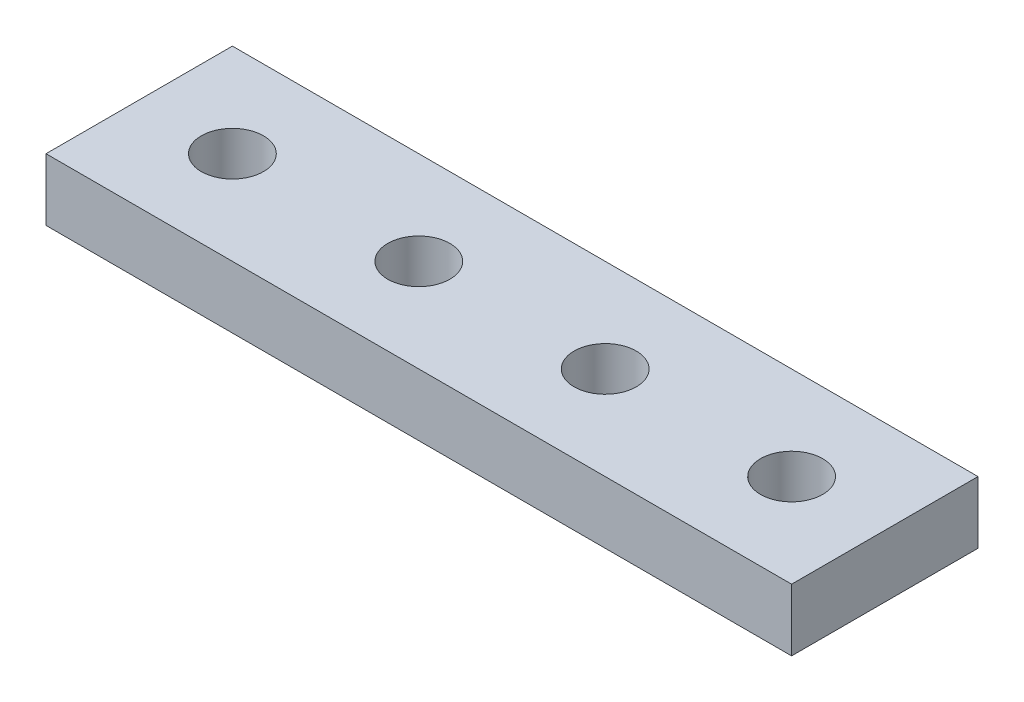
ISO-10303-21;
HEADER;
FILE_DESCRIPTION(('STEP AP214'),'2;1');
FILE_NAME('part.step','',(''),(''),'','','');
FILE_SCHEMA(('AUTOMOTIVE_DESIGN { 1 0 10303 214 1 1 1 1 }'));
ENDSEC;
DATA;
#1=APPLICATION_CONTEXT('core data for automotive mechanical design processes');
#2=APPLICATION_PROTOCOL_DEFINITION('international standard','automotive_design',2000,#1);
#3=PRODUCT_CONTEXT('',#1,'mechanical');
#4=PRODUCT('Part','Part','',(#3));
#5=PRODUCT_RELATED_PRODUCT_CATEGORY('part','',(#4));
#6=PRODUCT_DEFINITION_FORMATION('','',#4);
#7=PRODUCT_DEFINITION_CONTEXT('part definition',#1,'design');
#8=PRODUCT_DEFINITION('design','',#6,#7);
#9=PRODUCT_DEFINITION_SHAPE('','',#8);
#10=(LENGTH_UNIT() NAMED_UNIT(*) SI_UNIT(.MILLI.,.METRE.));
#11=(NAMED_UNIT(*) PLANE_ANGLE_UNIT() SI_UNIT($,.RADIAN.));
#12=(NAMED_UNIT(*) SI_UNIT($,.STERADIAN.) SOLID_ANGLE_UNIT());
#13=UNCERTAINTY_MEASURE_WITH_UNIT(LENGTH_MEASURE(1.E-05),#10,'distance_accuracy_value','');
#14=(GEOMETRIC_REPRESENTATION_CONTEXT(3) GLOBAL_UNCERTAINTY_ASSIGNED_CONTEXT((#13)) GLOBAL_UNIT_ASSIGNED_CONTEXT((#10,
#11,#12)) REPRESENTATION_CONTEXT('',''));
#15=CARTESIAN_POINT('',(0.,0.,0.));
#16=DIRECTION('',(0.,0.,1.));
#17=DIRECTION('',(1.,0.,0.));
#18=AXIS2_PLACEMENT_3D('',#15,#16,#17);
#19=CARTESIAN_POINT('',(0.,10.,0.));
#20=DIRECTION('',(0.,-1.,0.));
#21=DIRECTION('',(0.,0.,-1.));
#22=AXIS2_PLACEMENT_3D('',#19,#20,#21);
#23=PLANE('',#22);
#24=DIRECTION('',(0.,0.,1.));
#25=VECTOR('',#24,1.);
#26=CARTESIAN_POINT('',(0.,10.,0.));
#27=LINE('',#26,#25);
#28=CARTESIAN_POINT('',(0.,10.,-30.));
#29=VERTEX_POINT('',#28);
#30=CARTESIAN_POINT('',(0.,10.,0.));
#31=VERTEX_POINT('',#30);
#32=EDGE_CURVE('E93',#29,#31,#27,.T.);
#33=ORIENTED_EDGE('',*,*,#32,.T.);
#34=DIRECTION('',(1.,0.,0.));
#35=VECTOR('',#34,1.);
#36=CARTESIAN_POINT('',(0.,10.,0.));
#37=LINE('',#36,#35);
#38=CARTESIAN_POINT('',(120.,10.,0.));
#39=VERTEX_POINT('',#38);
#40=EDGE_CURVE('E88',#31,#39,#37,.T.);
#41=ORIENTED_EDGE('',*,*,#40,.T.);
#42=DIRECTION('',(0.,0.,-1.));
#43=VECTOR('',#42,1.);
#44=CARTESIAN_POINT('',(120.,10.,0.));
#45=LINE('',#44,#43);
#46=CARTESIAN_POINT('',(120.,10.,-30.));
#47=VERTEX_POINT('',#46);
#48=EDGE_CURVE('E91',#39,#47,#45,.T.);
#49=ORIENTED_EDGE('',*,*,#48,.T.);
#50=DIRECTION('',(-1.,0.,0.));
#51=VECTOR('',#50,1.);
#52=CARTESIAN_POINT('',(0.,10.,-30.));
#53=LINE('',#52,#51);
#54=EDGE_CURVE('E58',#47,#29,#53,.T.);
#55=ORIENTED_EDGE('',*,*,#54,.T.);
#56=EDGE_LOOP('',(#33,#41,#49,#55));
#57=FACE_BOUND('',#56,.T.);
#58=CARTESIAN_POINT('',(15.,10.,-15.));
#59=DIRECTION('',(0.,1.,0.));
#60=DIRECTION('',(0.,0.,1.));
#61=AXIS2_PLACEMENT_3D('',#58,#59,#60);
#62=CIRCLE('',#61,5.);
#63=CARTESIAN_POINT('',(15.,10.,-10.));
#64=VERTEX_POINT('',#63);
#65=EDGE_CURVE('E115',#64,#64,#62,.T.);
#66=ORIENTED_EDGE('',*,*,#65,.F.);
#67=EDGE_LOOP('',(#66));
#68=FACE_BOUND('',#67,.T.);
#69=CARTESIAN_POINT('',(45.,10.,-15.));
#70=DIRECTION('',(0.,1.,0.));
#71=DIRECTION('',(0.,0.,1.));
#72=AXIS2_PLACEMENT_3D('',#69,#70,#71);
#73=CIRCLE('',#72,5.);
#74=CARTESIAN_POINT('',(45.,10.,-10.));
#75=VERTEX_POINT('',#74);
#76=EDGE_CURVE('E141',#75,#75,#73,.T.);
#77=ORIENTED_EDGE('',*,*,#76,.F.);
#78=EDGE_LOOP('',(#77));
#79=FACE_BOUND('',#78,.T.);
#80=CARTESIAN_POINT('',(75.,10.,-15.));
#81=DIRECTION('',(0.,1.,0.));
#82=DIRECTION('',(0.,0.,1.));
#83=AXIS2_PLACEMENT_3D('',#80,#81,#82);
#84=CIRCLE('',#83,5.);
#85=CARTESIAN_POINT('',(75.,10.,-9.99999999999999));
#86=VERTEX_POINT('',#85);
#87=EDGE_CURVE('E149',#86,#86,#84,.T.);
#88=ORIENTED_EDGE('',*,*,#87,.F.);
#89=EDGE_LOOP('',(#88));
#90=FACE_BOUND('',#89,.T.);
#91=CARTESIAN_POINT('',(105.,9.99999999999999,-15.));
#92=DIRECTION('',(0.,1.,0.));
#93=DIRECTION('',(0.,0.,1.));
#94=AXIS2_PLACEMENT_3D('',#91,#92,#93);
#95=CIRCLE('',#94,5.);
#96=CARTESIAN_POINT('',(105.,9.99999999999999,-9.99999999999999));
#97=VERTEX_POINT('',#96);
#98=EDGE_CURVE('E157',#97,#97,#95,.T.);
#99=ORIENTED_EDGE('',*,*,#98,.F.);
#100=EDGE_LOOP('',(#99));
#101=FACE_BOUND('',#100,.T.);
#102=ADVANCED_FACE('F40',(#57,#68,#79,#90,#101),#23,.F.);
#103=CARTESIAN_POINT('',(0.,0.,0.));
#104=DIRECTION('',(0.,-1.,0.));
#105=DIRECTION('',(0.,0.,-1.));
#106=AXIS2_PLACEMENT_3D('',#103,#104,#105);
#107=PLANE('',#106);
#108=CARTESIAN_POINT('',(75.,0.,-15.));
#109=DIRECTION('',(0.,1.,0.));
#110=DIRECTION('',(0.,0.,1.));
#111=AXIS2_PLACEMENT_3D('',#108,#109,#110);
#112=CIRCLE('',#111,5.);
#113=CARTESIAN_POINT('',(75.,0.,-9.99999999999999));
#114=VERTEX_POINT('',#113);
#115=EDGE_CURVE('E153',#114,#114,#112,.T.);
#116=ORIENTED_EDGE('',*,*,#115,.T.);
#117=EDGE_LOOP('',(#116));
#118=FACE_BOUND('',#117,.T.);
#119=CARTESIAN_POINT('',(15.,0.,-15.));
#120=DIRECTION('',(0.,1.,0.));
#121=DIRECTION('',(0.,0.,1.));
#122=AXIS2_PLACEMENT_3D('',#119,#120,#121);
#123=CIRCLE('',#122,5.);
#124=CARTESIAN_POINT('',(15.,0.,-10.));
#125=VERTEX_POINT('',#124);
#126=EDGE_CURVE('E137',#125,#125,#123,.T.);
#127=ORIENTED_EDGE('',*,*,#126,.T.);
#128=EDGE_LOOP('',(#127));
#129=FACE_BOUND('',#128,.T.);
#130=DIRECTION('',(0.,0.,1.));
#131=VECTOR('',#130,1.);
#132=CARTESIAN_POINT('',(0.,0.,0.));
#133=LINE('',#132,#131);
#134=CARTESIAN_POINT('',(0.,0.,-30.));
#135=VERTEX_POINT('',#134);
#136=CARTESIAN_POINT('',(0.,0.,0.));
#137=VERTEX_POINT('',#136);
#138=EDGE_CURVE('E111',#135,#137,#133,.T.);
#139=ORIENTED_EDGE('',*,*,#138,.F.);
#140=DIRECTION('',(-1.,0.,0.));
#141=VECTOR('',#140,1.);
#142=CARTESIAN_POINT('',(0.,0.,-30.));
#143=LINE('',#142,#141);
#144=CARTESIAN_POINT('',(120.,0.,-30.));
#145=VERTEX_POINT('',#144);
#146=EDGE_CURVE('E81',#145,#135,#143,.T.);
#147=ORIENTED_EDGE('',*,*,#146,.F.);
#148=DIRECTION('',(0.,0.,-1.));
#149=VECTOR('',#148,1.);
#150=CARTESIAN_POINT('',(120.,0.,0.));
#151=LINE('',#150,#149);
#152=CARTESIAN_POINT('',(120.,0.,0.));
#153=VERTEX_POINT('',#152);
#154=EDGE_CURVE('E75',#153,#145,#151,.T.);
#155=ORIENTED_EDGE('',*,*,#154,.F.);
#156=DIRECTION('',(1.,0.,0.));
#157=VECTOR('',#156,1.);
#158=CARTESIAN_POINT('',(0.,0.,0.));
#159=LINE('',#158,#157);
#160=EDGE_CURVE('E98',#137,#153,#159,.T.);
#161=ORIENTED_EDGE('',*,*,#160,.F.);
#162=EDGE_LOOP('',(#139,#147,#155,#161));
#163=FACE_BOUND('',#162,.T.);
#164=CARTESIAN_POINT('',(45.,0.,-15.));
#165=DIRECTION('',(0.,1.,0.));
#166=DIRECTION('',(0.,0.,1.));
#167=AXIS2_PLACEMENT_3D('',#164,#165,#166);
#168=CIRCLE('',#167,5.);
#169=CARTESIAN_POINT('',(45.,0.,-10.));
#170=VERTEX_POINT('',#169);
#171=EDGE_CURVE('E145',#170,#170,#168,.T.);
#172=ORIENTED_EDGE('',*,*,#171,.T.);
#173=EDGE_LOOP('',(#172));
#174=FACE_BOUND('',#173,.T.);
#175=CARTESIAN_POINT('',(105.,0.,-15.));
#176=DIRECTION('',(0.,1.,0.));
#177=DIRECTION('',(0.,0.,1.));
#178=AXIS2_PLACEMENT_3D('',#175,#176,#177);
#179=CIRCLE('',#178,5.);
#180=CARTESIAN_POINT('',(105.,0.,-9.99999999999999));
#181=VERTEX_POINT('',#180);
#182=EDGE_CURVE('E161',#181,#181,#179,.T.);
#183=ORIENTED_EDGE('',*,*,#182,.T.);
#184=EDGE_LOOP('',(#183));
#185=FACE_BOUND('',#184,.T.);
#186=ADVANCED_FACE('F130',(#118,#129,#163,#174,#185),#107,.T.);
#187=CARTESIAN_POINT('',(0.,10.,0.));
#188=DIRECTION('',(1.,0.,0.));
#189=DIRECTION('',(0.,0.,-1.));
#190=AXIS2_PLACEMENT_3D('',#187,#188,#189);
#191=PLANE('',#190);
#192=ORIENTED_EDGE('',*,*,#138,.T.);
#193=DIRECTION('',(0.,-1.,0.));
#194=VECTOR('',#193,1.);
#195=CARTESIAN_POINT('',(0.,10.,0.));
#196=LINE('',#195,#194);
#197=EDGE_CURVE('E11',#31,#137,#196,.T.);
#198=ORIENTED_EDGE('',*,*,#197,.F.);
#199=ORIENTED_EDGE('',*,*,#32,.F.);
#200=DIRECTION('',(0.,-1.,0.));
#201=VECTOR('',#200,1.);
#202=CARTESIAN_POINT('',(0.,10.,-30.));
#203=LINE('',#202,#201);
#204=EDGE_CURVE('E107',#29,#135,#203,.T.);
#205=ORIENTED_EDGE('',*,*,#204,.T.);
#206=EDGE_LOOP('',(#192,#198,#199,#205));
#207=FACE_BOUND('',#206,.T.);
#208=ADVANCED_FACE('F42',(#207),#191,.F.);
#209=CARTESIAN_POINT('',(0.,10.,0.));
#210=DIRECTION('',(0.,0.,-1.));
#211=DIRECTION('',(-1.,0.,0.));
#212=AXIS2_PLACEMENT_3D('',#209,#210,#211);
#213=PLANE('',#212);
#214=ORIENTED_EDGE('',*,*,#160,.T.);
#215=DIRECTION('',(0.,-1.,0.));
#216=VECTOR('',#215,1.);
#217=CARTESIAN_POINT('',(120.,10.,0.));
#218=LINE('',#217,#216);
#219=EDGE_CURVE('E50',#39,#153,#218,.T.);
#220=ORIENTED_EDGE('',*,*,#219,.F.);
#221=ORIENTED_EDGE('',*,*,#40,.F.);
#222=ORIENTED_EDGE('',*,*,#197,.T.);
#223=EDGE_LOOP('',(#214,#220,#221,#222));
#224=FACE_BOUND('',#223,.T.);
#225=ADVANCED_FACE('F97',(#224),#213,.F.);
#226=CARTESIAN_POINT('',(120.,10.,0.));
#227=DIRECTION('',(-1.,0.,0.));
#228=DIRECTION('',(0.,0.,1.));
#229=AXIS2_PLACEMENT_3D('',#226,#227,#228);
#230=PLANE('',#229);
#231=ORIENTED_EDGE('',*,*,#154,.T.);
#232=DIRECTION('',(0.,-1.,0.));
#233=VECTOR('',#232,1.);
#234=CARTESIAN_POINT('',(120.,10.,-30.));
#235=LINE('',#234,#233);
#236=EDGE_CURVE('E100',#47,#145,#235,.T.);
#237=ORIENTED_EDGE('',*,*,#236,.F.);
#238=ORIENTED_EDGE('',*,*,#48,.F.);
#239=ORIENTED_EDGE('',*,*,#219,.T.);
#240=EDGE_LOOP('',(#231,#237,#238,#239));
#241=FACE_BOUND('',#240,.T.);
#242=ADVANCED_FACE('F101',(#241),#230,.F.);
#243=CARTESIAN_POINT('',(0.,10.,-30.));
#244=DIRECTION('',(0.,0.,1.));
#245=DIRECTION('',(1.,0.,0.));
#246=AXIS2_PLACEMENT_3D('',#243,#244,#245);
#247=PLANE('',#246);
#248=ORIENTED_EDGE('',*,*,#146,.T.);
#249=ORIENTED_EDGE('',*,*,#204,.F.);
#250=ORIENTED_EDGE('',*,*,#54,.F.);
#251=ORIENTED_EDGE('',*,*,#236,.T.);
#252=EDGE_LOOP('',(#248,#249,#250,#251));
#253=FACE_BOUND('',#252,.T.);
#254=ADVANCED_FACE('F127',(#253),#247,.F.);
#255=CARTESIAN_POINT('',(15.,10.,-15.));
#256=DIRECTION('',(0.,-1.,0.));
#257=DIRECTION('',(0.,0.,-1.));
#258=AXIS2_PLACEMENT_3D('',#255,#256,#257);
#259=CYLINDRICAL_SURFACE('',#258,5.);
#260=ORIENTED_EDGE('',*,*,#65,.T.);
#261=EDGE_LOOP('',(#260));
#262=FACE_BOUND('',#261,.T.);
#263=ORIENTED_EDGE('',*,*,#126,.F.);
#264=EDGE_LOOP('',(#263));
#265=FACE_BOUND('',#264,.T.);
#266=ADVANCED_FACE('F182',(#262,#265),#259,.F.);
#267=CARTESIAN_POINT('',(45.,10.,-15.));
#268=DIRECTION('',(0.,-1.,0.));
#269=DIRECTION('',(0.,0.,-1.));
#270=AXIS2_PLACEMENT_3D('',#267,#268,#269);
#271=CYLINDRICAL_SURFACE('',#270,5.);
#272=ORIENTED_EDGE('',*,*,#76,.T.);
#273=EDGE_LOOP('',(#272));
#274=FACE_BOUND('',#273,.T.);
#275=ORIENTED_EDGE('',*,*,#171,.F.);
#276=EDGE_LOOP('',(#275));
#277=FACE_BOUND('',#276,.T.);
#278=ADVANCED_FACE('F228',(#274,#277),#271,.F.);
#279=CARTESIAN_POINT('',(75.,10.,-15.));
#280=DIRECTION('',(0.,-1.,0.));
#281=DIRECTION('',(0.,0.,-1.));
#282=AXIS2_PLACEMENT_3D('',#279,#280,#281);
#283=CYLINDRICAL_SURFACE('',#282,5.);
#284=ORIENTED_EDGE('',*,*,#87,.T.);
#285=EDGE_LOOP('',(#284));
#286=FACE_BOUND('',#285,.T.);
#287=ORIENTED_EDGE('',*,*,#115,.F.);
#288=EDGE_LOOP('',(#287));
#289=FACE_BOUND('',#288,.T.);
#290=ADVANCED_FACE('F236',(#286,#289),#283,.F.);
#291=CARTESIAN_POINT('',(105.,9.99999999999999,-15.));
#292=DIRECTION('',(0.,-1.,0.));
#293=DIRECTION('',(0.,0.,-1.));
#294=AXIS2_PLACEMENT_3D('',#291,#292,#293);
#295=CYLINDRICAL_SURFACE('',#294,5.);
#296=ORIENTED_EDGE('',*,*,#98,.T.);
#297=EDGE_LOOP('',(#296));
#298=FACE_BOUND('',#297,.T.);
#299=ORIENTED_EDGE('',*,*,#182,.F.);
#300=EDGE_LOOP('',(#299));
#301=FACE_BOUND('',#300,.T.);
#302=ADVANCED_FACE('F171',(#298,#301),#295,.F.);
#303=CLOSED_SHELL('',(#102,#186,#208,#225,#242,#254,#266,#278,#290,#302));
#304=MANIFOLD_SOLID_BREP('B2',#303);
#305=ADVANCED_BREP_SHAPE_REPRESENTATION('',(#18,#304),#14);
#306=SHAPE_DEFINITION_REPRESENTATION(#9,#305);
ENDSEC;
END-ISO-10303-21;
